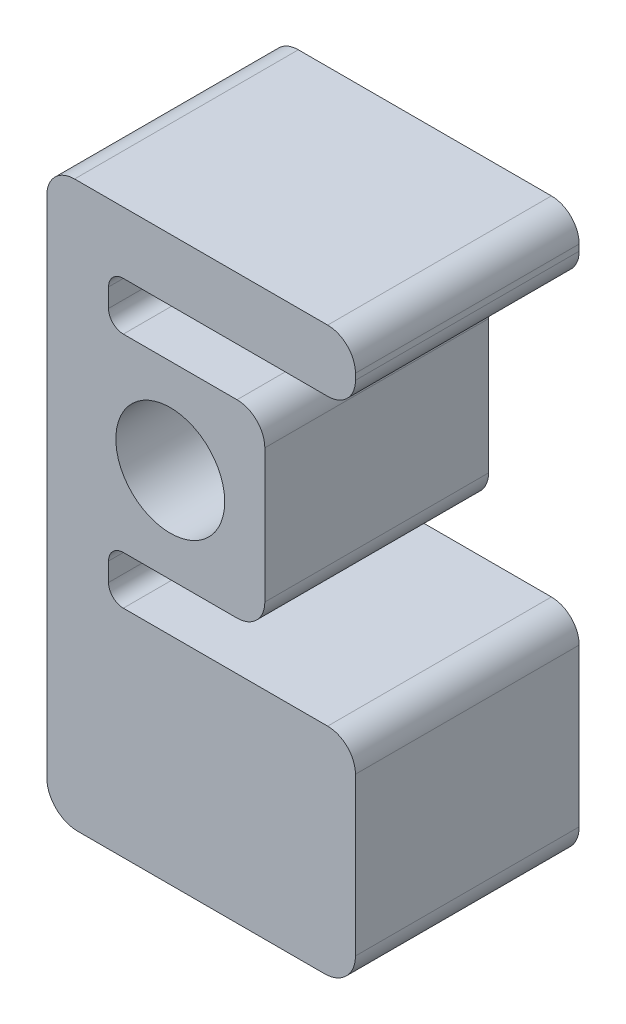
ISO-10303-21;
HEADER;
FILE_DESCRIPTION(('STEP AP214'),'2;1');
FILE_NAME('part.step','',(''),(''),'','','');
FILE_SCHEMA(('AUTOMOTIVE_DESIGN { 1 0 10303 214 1 1 1 1 }'));
ENDSEC;
DATA;
#1=APPLICATION_CONTEXT('core data for automotive mechanical design processes');
#2=APPLICATION_PROTOCOL_DEFINITION('international standard','automotive_design',2000,#1);
#3=PRODUCT_CONTEXT('',#1,'mechanical');
#4=PRODUCT('Part','Part','',(#3));
#5=PRODUCT_RELATED_PRODUCT_CATEGORY('part','',(#4));
#6=PRODUCT_DEFINITION_FORMATION('','',#4);
#7=PRODUCT_DEFINITION_CONTEXT('part definition',#1,'design');
#8=PRODUCT_DEFINITION('design','',#6,#7);
#9=PRODUCT_DEFINITION_SHAPE('','',#8);
#10=(LENGTH_UNIT() NAMED_UNIT(*) SI_UNIT(.MILLI.,.METRE.));
#11=(NAMED_UNIT(*) PLANE_ANGLE_UNIT() SI_UNIT($,.RADIAN.));
#12=(NAMED_UNIT(*) SI_UNIT($,.STERADIAN.) SOLID_ANGLE_UNIT());
#13=UNCERTAINTY_MEASURE_WITH_UNIT(LENGTH_MEASURE(1.E-05),#10,'distance_accuracy_value','');
#14=(GEOMETRIC_REPRESENTATION_CONTEXT(3) GLOBAL_UNCERTAINTY_ASSIGNED_CONTEXT((#13)) GLOBAL_UNIT_ASSIGNED_CONTEXT((#10,
#11,#12)) REPRESENTATION_CONTEXT('',''));
#15=CARTESIAN_POINT('',(0.,0.,0.));
#16=DIRECTION('',(0.,0.,1.));
#17=DIRECTION('',(1.,0.,0.));
#18=AXIS2_PLACEMENT_3D('',#15,#16,#17);
#19=CARTESIAN_POINT('',(-9.65199999999999,-22.503,46.0375));
#20=DIRECTION('',(0.,0.,-1.));
#21=DIRECTION('',(-1.,0.,0.));
#22=AXIS2_PLACEMENT_3D('',#19,#20,#21);
#23=PLANE('',#22);
#24=DIRECTION('',(1.,0.,0.));
#25=VECTOR('',#24,1.);
#26=CARTESIAN_POINT('',(13.74,-19.455,46.0375));
#27=LINE('',#26,#25);
#28=CARTESIAN_POINT('',(-9.65199999999999,-19.455,46.0375));
#29=VERTEX_POINT('',#28);
#30=CARTESIAN_POINT('',(13.74,-19.455,46.0375));
#31=VERTEX_POINT('',#30);
#32=EDGE_CURVE('E63',#29,#31,#27,.T.);
#33=ORIENTED_EDGE('',*,*,#32,.T.);
#34=CARTESIAN_POINT('',(13.74,-13.74,46.0375));
#35=DIRECTION('',(0.,0.,1.));
#36=DIRECTION('',(-1.,0.,0.));
#37=AXIS2_PLACEMENT_3D('',#34,#35,#36);
#38=CIRCLE('',#37,5.715);
#39=CARTESIAN_POINT('',(19.455,-13.74,46.0375));
#40=VERTEX_POINT('',#39);
#41=EDGE_CURVE('E155',#31,#40,#38,.T.);
#42=ORIENTED_EDGE('',*,*,#41,.T.);
#43=DIRECTION('',(0.,1.,0.));
#44=VECTOR('',#43,1.);
#45=CARTESIAN_POINT('',(19.455,0.,46.0375));
#46=LINE('',#45,#44);
#47=CARTESIAN_POINT('',(19.455,13.74,46.0375));
#48=VERTEX_POINT('',#47);
#49=EDGE_CURVE('E402',#40,#48,#46,.T.);
#50=ORIENTED_EDGE('',*,*,#49,.T.);
#51=CARTESIAN_POINT('',(13.74,13.74,46.0375));
#52=DIRECTION('',(0.,0.,1.));
#53=DIRECTION('',(-1.,0.,0.));
#54=AXIS2_PLACEMENT_3D('',#51,#52,#53);
#55=CIRCLE('',#54,5.715);
#56=CARTESIAN_POINT('',(13.74,19.455,46.0375));
#57=VERTEX_POINT('',#56);
#58=EDGE_CURVE('E422',#48,#57,#55,.T.);
#59=ORIENTED_EDGE('',*,*,#58,.T.);
#60=DIRECTION('',(-1.,0.,0.));
#61=VECTOR('',#60,1.);
#62=CARTESIAN_POINT('',(0.,19.455,46.0375));
#63=LINE('',#62,#61);
#64=CARTESIAN_POINT('',(-9.65199999999999,19.455,46.0375));
#65=VERTEX_POINT('',#64);
#66=EDGE_CURVE('E418',#57,#65,#63,.T.);
#67=ORIENTED_EDGE('',*,*,#66,.T.);
#68=CARTESIAN_POINT('',(-9.65199999999999,22.503,46.0375));
#69=DIRECTION('',(0.,0.,-1.));
#70=DIRECTION('',(-1.,0.,0.));
#71=AXIS2_PLACEMENT_3D('',#68,#69,#70);
#72=CIRCLE('',#71,3.048);
#73=CARTESIAN_POINT('',(-12.7,22.503,46.0375));
#74=VERTEX_POINT('',#73);
#75=EDGE_CURVE('E421',#65,#74,#72,.T.);
#76=ORIENTED_EDGE('',*,*,#75,.T.);
#77=DIRECTION('',(0.,1.,0.));
#78=VECTOR('',#77,1.);
#79=CARTESIAN_POINT('',(-12.7,22.503,46.0375));
#80=LINE('',#79,#78);
#81=CARTESIAN_POINT('',(-12.7,26.332,46.0375));
#82=VERTEX_POINT('',#81);
#83=EDGE_CURVE('E426',#74,#82,#80,.T.);
#84=ORIENTED_EDGE('',*,*,#83,.T.);
#85=CARTESIAN_POINT('',(-9.65199999999999,26.332,46.0375));
#86=DIRECTION('',(0.,0.,-1.));
#87=DIRECTION('',(-1.,0.,0.));
#88=AXIS2_PLACEMENT_3D('',#85,#86,#87);
#89=CIRCLE('',#88,3.048);
#90=CARTESIAN_POINT('',(-9.65199999999999,29.38,46.0375));
#91=VERTEX_POINT('',#90);
#92=EDGE_CURVE('E433',#82,#91,#89,.T.);
#93=ORIENTED_EDGE('',*,*,#92,.T.);
#94=DIRECTION('',(1.,0.,0.));
#95=VECTOR('',#94,1.);
#96=CARTESIAN_POINT('',(-9.65199999999999,29.38,46.0375));
#97=LINE('',#96,#95);
#98=CARTESIAN_POINT('',(32.385,29.38,46.0375));
#99=VERTEX_POINT('',#98);
#100=EDGE_CURVE('E436',#91,#99,#97,.T.);
#101=ORIENTED_EDGE('',*,*,#100,.T.);
#102=CARTESIAN_POINT('',(32.385,35.095,46.0375));
#103=DIRECTION('',(0.,0.,1.));
#104=DIRECTION('',(1.,0.,0.));
#105=AXIS2_PLACEMENT_3D('',#102,#103,#104);
#106=CIRCLE('',#105,5.715);
#107=CARTESIAN_POINT('',(38.1,35.095,46.0375));
#108=VERTEX_POINT('',#107);
#109=EDGE_CURVE('E439',#99,#108,#106,.T.);
#110=ORIENTED_EDGE('',*,*,#109,.T.);
#111=DIRECTION('',(0.,1.,0.));
#112=VECTOR('',#111,1.);
#113=CARTESIAN_POINT('',(38.1,35.095,46.0375));
#114=LINE('',#113,#112);
#115=CARTESIAN_POINT('',(38.1,36.365,46.0375));
#116=VERTEX_POINT('',#115);
#117=EDGE_CURVE('E442',#108,#116,#114,.T.);
#118=ORIENTED_EDGE('',*,*,#117,.T.);
#119=CARTESIAN_POINT('',(32.385,36.365,46.0375));
#120=DIRECTION('',(0.,0.,1.));
#121=DIRECTION('',(1.,0.,0.));
#122=AXIS2_PLACEMENT_3D('',#119,#120,#121);
#123=CIRCLE('',#122,5.715);
#124=CARTESIAN_POINT('',(32.385,42.08,46.0375));
#125=VERTEX_POINT('',#124);
#126=EDGE_CURVE('E445',#116,#125,#123,.T.);
#127=ORIENTED_EDGE('',*,*,#126,.T.);
#128=DIRECTION('',(-1.,0.,0.));
#129=VECTOR('',#128,1.);
#130=CARTESIAN_POINT('',(32.385,42.08,46.0375));
#131=LINE('',#130,#129);
#132=CARTESIAN_POINT('',(-19.685,42.08,46.0375));
#133=VERTEX_POINT('',#132);
#134=EDGE_CURVE('E448',#125,#133,#131,.T.);
#135=ORIENTED_EDGE('',*,*,#134,.T.);
#136=CARTESIAN_POINT('',(-19.685,36.365,46.0375));
#137=DIRECTION('',(0.,0.,1.));
#138=DIRECTION('',(1.,0.,0.));
#139=AXIS2_PLACEMENT_3D('',#136,#137,#138);
#140=CIRCLE('',#139,5.71499999999999);
#141=CARTESIAN_POINT('',(-25.4,36.365,46.0375));
#142=VERTEX_POINT('',#141);
#143=EDGE_CURVE('E451',#133,#142,#140,.T.);
#144=ORIENTED_EDGE('',*,*,#143,.T.);
#145=DIRECTION('',(0.,-1.,0.));
#146=VECTOR('',#145,1.);
#147=CARTESIAN_POINT('',(-25.4,-67.4799999619999,46.0375));
#148=LINE('',#147,#146);
#149=CARTESIAN_POINT('',(-25.4,-67.479999962,46.0375));
#150=VERTEX_POINT('',#149);
#151=EDGE_CURVE('E454',#142,#150,#148,.T.);
#152=ORIENTED_EDGE('',*,*,#151,.T.);
#153=CARTESIAN_POINT('',(-19.05,-67.479999962,46.0375));
#154=DIRECTION('',(0.,0.,1.));
#155=DIRECTION('',(-1.,0.,0.));
#156=AXIS2_PLACEMENT_3D('',#153,#154,#155);
#157=CIRCLE('',#156,6.35);
#158=CARTESIAN_POINT('',(-19.0499999999999,-73.829999962,46.0375));
#159=VERTEX_POINT('',#158);
#160=EDGE_CURVE('E457',#150,#159,#157,.T.);
#161=ORIENTED_EDGE('',*,*,#160,.T.);
#162=DIRECTION('',(1.,0.,0.));
#163=VECTOR('',#162,1.);
#164=CARTESIAN_POINT('',(31.75,-73.829999962,46.0375));
#165=LINE('',#164,#163);
#166=CARTESIAN_POINT('',(31.75,-73.829999962,46.0375));
#167=VERTEX_POINT('',#166);
#168=EDGE_CURVE('E460',#159,#167,#165,.T.);
#169=ORIENTED_EDGE('',*,*,#168,.T.);
#170=CARTESIAN_POINT('',(31.75,-67.479999962,46.0375));
#171=DIRECTION('',(0.,0.,1.));
#172=DIRECTION('',(1.,0.,0.));
#173=AXIS2_PLACEMENT_3D('',#170,#171,#172);
#174=CIRCLE('',#173,6.35);
#175=CARTESIAN_POINT('',(38.1,-67.4799999619999,46.0375));
#176=VERTEX_POINT('',#175);
#177=EDGE_CURVE('E463',#167,#176,#174,.T.);
#178=ORIENTED_EDGE('',*,*,#177,.T.);
#179=DIRECTION('',(0.,1.,0.));
#180=VECTOR('',#179,1.);
#181=CARTESIAN_POINT('',(38.1,-67.4799999619999,46.0375));
#182=LINE('',#181,#180);
#183=CARTESIAN_POINT('',(38.1,-35.094999962,46.0375));
#184=VERTEX_POINT('',#183);
#185=EDGE_CURVE('E466',#176,#184,#182,.T.);
#186=ORIENTED_EDGE('',*,*,#185,.T.);
#187=CARTESIAN_POINT('',(32.385,-35.094999962,46.0375));
#188=DIRECTION('',(0.,0.,1.));
#189=DIRECTION('',(1.,0.,0.));
#190=AXIS2_PLACEMENT_3D('',#187,#188,#189);
#191=CIRCLE('',#190,5.71499999999999);
#192=CARTESIAN_POINT('',(32.385,-29.379999962,46.0375));
#193=VERTEX_POINT('',#192);
#194=EDGE_CURVE('E469',#184,#193,#191,.T.);
#195=ORIENTED_EDGE('',*,*,#194,.T.);
#196=DIRECTION('',(-1.,0.,0.));
#197=VECTOR('',#196,1.);
#198=CARTESIAN_POINT('',(32.385,-29.379999962,46.0375));
#199=LINE('',#198,#197);
#200=CARTESIAN_POINT('',(-9.65199999999999,-29.379999962,46.0375));
#201=VERTEX_POINT('',#200);
#202=EDGE_CURVE('E223',#193,#201,#199,.T.);
#203=ORIENTED_EDGE('',*,*,#202,.T.);
#204=CARTESIAN_POINT('',(-9.65199999999999,-26.331999962,46.0375));
#205=DIRECTION('',(0.,0.,-1.));
#206=DIRECTION('',(-1.,0.,0.));
#207=AXIS2_PLACEMENT_3D('',#204,#205,#206);
#208=CIRCLE('',#207,3.048);
#209=CARTESIAN_POINT('',(-12.7,-26.331999962,46.0375));
#210=VERTEX_POINT('',#209);
#211=EDGE_CURVE('E217',#201,#210,#208,.T.);
#212=ORIENTED_EDGE('',*,*,#211,.T.);
#213=DIRECTION('',(0.,1.,0.));
#214=VECTOR('',#213,1.);
#215=CARTESIAN_POINT('',(-12.7,-26.331999962,46.0375));
#216=LINE('',#215,#214);
#217=CARTESIAN_POINT('',(-12.7,-22.503,46.0375));
#218=VERTEX_POINT('',#217);
#219=EDGE_CURVE('E221',#210,#218,#216,.T.);
#220=ORIENTED_EDGE('',*,*,#219,.T.);
#221=CARTESIAN_POINT('',(-9.65199999999999,-22.503,46.0375));
#222=DIRECTION('',(0.,0.,-1.));
#223=DIRECTION('',(-1.,0.,0.));
#224=AXIS2_PLACEMENT_3D('',#221,#222,#223);
#225=CIRCLE('',#224,3.048);
#226=EDGE_CURVE('E240',#218,#29,#225,.T.);
#227=ORIENTED_EDGE('',*,*,#226,.T.);
#228=EDGE_LOOP('',(#33,#42,#50,#59,#67,#76,#84,#93,#101,#110,#118,#127,#135,#144,#152,#161,#169,
#178,#186,#195,#203,#212,#220,#227));
#229=FACE_BOUND('',#228,.T.);
#230=CARTESIAN_POINT('',(0.,0.,46.0375));
#231=DIRECTION('',(0.,0.,1.));
#232=DIRECTION('',(1.,0.,0.));
#233=AXIS2_PLACEMENT_3D('',#230,#231,#232);
#234=CIRCLE('',#233,11.2);
#235=CARTESIAN_POINT('',(11.2,0.,46.0375));
#236=VERTEX_POINT('',#235);
#237=EDGE_CURVE('E252',#236,#236,#234,.T.);
#238=ORIENTED_EDGE('',*,*,#237,.F.);
#239=EDGE_LOOP('',(#238));
#240=FACE_BOUND('',#239,.T.);
#241=ADVANCED_FACE('F45',(#229,#240),#23,.F.);
#242=CARTESIAN_POINT('',(-9.65199999999999,-22.503,0.));
#243=DIRECTION('',(0.,0.,-1.));
#244=DIRECTION('',(-1.,0.,0.));
#245=AXIS2_PLACEMENT_3D('',#242,#243,#244);
#246=PLANE('',#245);
#247=CARTESIAN_POINT('',(13.74,-13.74,0.));
#248=DIRECTION('',(0.,0.,1.));
#249=DIRECTION('',(-1.,0.,0.));
#250=AXIS2_PLACEMENT_3D('',#247,#248,#249);
#251=CIRCLE('',#250,5.715);
#252=CARTESIAN_POINT('',(13.74,-19.455,0.));
#253=VERTEX_POINT('',#252);
#254=CARTESIAN_POINT('',(19.455,-13.74,0.));
#255=VERTEX_POINT('',#254);
#256=EDGE_CURVE('E247',#253,#255,#251,.T.);
#257=ORIENTED_EDGE('',*,*,#256,.F.);
#258=DIRECTION('',(1.,0.,0.));
#259=VECTOR('',#258,1.);
#260=CARTESIAN_POINT('',(-9.65199999999999,-19.455,0.));
#261=LINE('',#260,#259);
#262=CARTESIAN_POINT('',(-9.65199999999999,-19.455,0.));
#263=VERTEX_POINT('',#262);
#264=EDGE_CURVE('E316',#263,#253,#261,.T.);
#265=ORIENTED_EDGE('',*,*,#264,.F.);
#266=CARTESIAN_POINT('',(-9.65199999999999,-22.503,0.));
#267=DIRECTION('',(0.,0.,-1.));
#268=DIRECTION('',(-1.,0.,0.));
#269=AXIS2_PLACEMENT_3D('',#266,#267,#268);
#270=CIRCLE('',#269,3.048);
#271=CARTESIAN_POINT('',(-12.7,-22.503,0.));
#272=VERTEX_POINT('',#271);
#273=EDGE_CURVE('E148',#272,#263,#270,.T.);
#274=ORIENTED_EDGE('',*,*,#273,.F.);
#275=DIRECTION('',(0.,1.,0.));
#276=VECTOR('',#275,1.);
#277=CARTESIAN_POINT('',(-12.7,-26.331999962,0.));
#278=LINE('',#277,#276);
#279=CARTESIAN_POINT('',(-12.7,-26.331999962,0.));
#280=VERTEX_POINT('',#279);
#281=EDGE_CURVE('E141',#280,#272,#278,.T.);
#282=ORIENTED_EDGE('',*,*,#281,.F.);
#283=CARTESIAN_POINT('',(-9.65199999999999,-26.331999962,0.));
#284=DIRECTION('',(0.,0.,-1.));
#285=DIRECTION('',(-1.,0.,0.));
#286=AXIS2_PLACEMENT_3D('',#283,#284,#285);
#287=CIRCLE('',#286,3.048);
#288=CARTESIAN_POINT('',(-9.65199999999999,-29.379999962,0.));
#289=VERTEX_POINT('',#288);
#290=EDGE_CURVE('E232',#289,#280,#287,.T.);
#291=ORIENTED_EDGE('',*,*,#290,.F.);
#292=DIRECTION('',(-1.,0.,0.));
#293=VECTOR('',#292,1.);
#294=CARTESIAN_POINT('',(32.385,-29.379999962,0.));
#295=LINE('',#294,#293);
#296=CARTESIAN_POINT('',(32.385,-29.379999962,0.));
#297=VERTEX_POINT('',#296);
#298=EDGE_CURVE('E307',#297,#289,#295,.T.);
#299=ORIENTED_EDGE('',*,*,#298,.F.);
#300=CARTESIAN_POINT('',(32.385,-35.094999962,0.));
#301=DIRECTION('',(0.,0.,1.));
#302=DIRECTION('',(1.,0.,0.));
#303=AXIS2_PLACEMENT_3D('',#300,#301,#302);
#304=CIRCLE('',#303,5.71499999999999);
#305=CARTESIAN_POINT('',(38.1,-35.094999962,0.));
#306=VERTEX_POINT('',#305);
#307=EDGE_CURVE('E304',#306,#297,#304,.T.);
#308=ORIENTED_EDGE('',*,*,#307,.F.);
#309=DIRECTION('',(0.,1.,0.));
#310=VECTOR('',#309,1.);
#311=CARTESIAN_POINT('',(38.1,-67.4799999619999,0.));
#312=LINE('',#311,#310);
#313=CARTESIAN_POINT('',(38.1,-67.4799999619999,0.));
#314=VERTEX_POINT('',#313);
#315=EDGE_CURVE('E301',#314,#306,#312,.T.);
#316=ORIENTED_EDGE('',*,*,#315,.F.);
#317=CARTESIAN_POINT('',(31.75,-67.479999962,0.));
#318=DIRECTION('',(0.,0.,1.));
#319=DIRECTION('',(1.,0.,0.));
#320=AXIS2_PLACEMENT_3D('',#317,#318,#319);
#321=CIRCLE('',#320,6.35);
#322=CARTESIAN_POINT('',(31.75,-73.829999962,0.));
#323=VERTEX_POINT('',#322);
#324=EDGE_CURVE('E298',#323,#314,#321,.T.);
#325=ORIENTED_EDGE('',*,*,#324,.F.);
#326=DIRECTION('',(1.,0.,0.));
#327=VECTOR('',#326,1.);
#328=CARTESIAN_POINT('',(31.75,-73.829999962,0.));
#329=LINE('',#328,#327);
#330=CARTESIAN_POINT('',(-19.0499999999999,-73.829999962,0.));
#331=VERTEX_POINT('',#330);
#332=EDGE_CURVE('E295',#331,#323,#329,.T.);
#333=ORIENTED_EDGE('',*,*,#332,.F.);
#334=CARTESIAN_POINT('',(-19.05,-67.479999962,0.));
#335=DIRECTION('',(0.,0.,1.));
#336=DIRECTION('',(-1.,0.,0.));
#337=AXIS2_PLACEMENT_3D('',#334,#335,#336);
#338=CIRCLE('',#337,6.35);
#339=CARTESIAN_POINT('',(-25.4,-67.479999962,0.));
#340=VERTEX_POINT('',#339);
#341=EDGE_CURVE('E292',#340,#331,#338,.T.);
#342=ORIENTED_EDGE('',*,*,#341,.F.);
#343=DIRECTION('',(0.,-1.,0.));
#344=VECTOR('',#343,1.);
#345=CARTESIAN_POINT('',(-25.4,-67.4799999619999,0.));
#346=LINE('',#345,#344);
#347=CARTESIAN_POINT('',(-25.4,36.365,0.));
#348=VERTEX_POINT('',#347);
#349=EDGE_CURVE('E289',#348,#340,#346,.T.);
#350=ORIENTED_EDGE('',*,*,#349,.F.);
#351=CARTESIAN_POINT('',(-19.685,36.365,0.));
#352=DIRECTION('',(0.,0.,1.));
#353=DIRECTION('',(1.,0.,0.));
#354=AXIS2_PLACEMENT_3D('',#351,#352,#353);
#355=CIRCLE('',#354,5.71499999999999);
#356=CARTESIAN_POINT('',(-19.685,42.08,0.));
#357=VERTEX_POINT('',#356);
#358=EDGE_CURVE('E286',#357,#348,#355,.T.);
#359=ORIENTED_EDGE('',*,*,#358,.F.);
#360=DIRECTION('',(-1.,0.,0.));
#361=VECTOR('',#360,1.);
#362=CARTESIAN_POINT('',(32.385,42.08,0.));
#363=LINE('',#362,#361);
#364=CARTESIAN_POINT('',(32.385,42.08,0.));
#365=VERTEX_POINT('',#364);
#366=EDGE_CURVE('E283',#365,#357,#363,.T.);
#367=ORIENTED_EDGE('',*,*,#366,.F.);
#368=CARTESIAN_POINT('',(32.385,36.365,0.));
#369=DIRECTION('',(0.,0.,1.));
#370=DIRECTION('',(1.,0.,0.));
#371=AXIS2_PLACEMENT_3D('',#368,#369,#370);
#372=CIRCLE('',#371,5.715);
#373=CARTESIAN_POINT('',(38.1,36.365,0.));
#374=VERTEX_POINT('',#373);
#375=EDGE_CURVE('E280',#374,#365,#372,.T.);
#376=ORIENTED_EDGE('',*,*,#375,.F.);
#377=DIRECTION('',(0.,1.,0.));
#378=VECTOR('',#377,1.);
#379=CARTESIAN_POINT('',(38.1,35.095,0.));
#380=LINE('',#379,#378);
#381=CARTESIAN_POINT('',(38.1,35.095,0.));
#382=VERTEX_POINT('',#381);
#383=EDGE_CURVE('E277',#382,#374,#380,.T.);
#384=ORIENTED_EDGE('',*,*,#383,.F.);
#385=CARTESIAN_POINT('',(32.385,35.095,0.));
#386=DIRECTION('',(0.,0.,1.));
#387=DIRECTION('',(1.,0.,0.));
#388=AXIS2_PLACEMENT_3D('',#385,#386,#387);
#389=CIRCLE('',#388,5.715);
#390=CARTESIAN_POINT('',(32.385,29.38,0.));
#391=VERTEX_POINT('',#390);
#392=EDGE_CURVE('E274',#391,#382,#389,.T.);
#393=ORIENTED_EDGE('',*,*,#392,.F.);
#394=DIRECTION('',(1.,0.,0.));
#395=VECTOR('',#394,1.);
#396=CARTESIAN_POINT('',(-9.65199999999999,29.38,0.));
#397=LINE('',#396,#395);
#398=CARTESIAN_POINT('',(-9.65199999999999,29.38,0.));
#399=VERTEX_POINT('',#398);
#400=EDGE_CURVE('E271',#399,#391,#397,.T.);
#401=ORIENTED_EDGE('',*,*,#400,.F.);
#402=CARTESIAN_POINT('',(-9.65199999999999,26.332,0.));
#403=DIRECTION('',(0.,0.,-1.));
#404=DIRECTION('',(-1.,0.,0.));
#405=AXIS2_PLACEMENT_3D('',#402,#403,#404);
#406=CIRCLE('',#405,3.048);
#407=CARTESIAN_POINT('',(-12.7,26.332,0.));
#408=VERTEX_POINT('',#407);
#409=EDGE_CURVE('E268',#408,#399,#406,.T.);
#410=ORIENTED_EDGE('',*,*,#409,.F.);
#411=DIRECTION('',(0.,1.,0.));
#412=VECTOR('',#411,1.);
#413=CARTESIAN_POINT('',(-12.7,22.503,0.));
#414=LINE('',#413,#412);
#415=CARTESIAN_POINT('',(-12.7,22.503,0.));
#416=VERTEX_POINT('',#415);
#417=EDGE_CURVE('E265',#416,#408,#414,.T.);
#418=ORIENTED_EDGE('',*,*,#417,.F.);
#419=CARTESIAN_POINT('',(-9.65199999999999,22.503,0.));
#420=DIRECTION('',(0.,0.,-1.));
#421=DIRECTION('',(-1.,0.,0.));
#422=AXIS2_PLACEMENT_3D('',#419,#420,#421);
#423=CIRCLE('',#422,3.048);
#424=CARTESIAN_POINT('',(-9.65199999999999,19.455,0.));
#425=VERTEX_POINT('',#424);
#426=EDGE_CURVE('E262',#425,#416,#423,.T.);
#427=ORIENTED_EDGE('',*,*,#426,.F.);
#428=DIRECTION('',(-1.,0.,0.));
#429=VECTOR('',#428,1.);
#430=CARTESIAN_POINT('',(-9.65199999999999,19.455,0.));
#431=LINE('',#430,#429);
#432=CARTESIAN_POINT('',(13.74,19.455,0.));
#433=VERTEX_POINT('',#432);
#434=EDGE_CURVE('E259',#433,#425,#431,.T.);
#435=ORIENTED_EDGE('',*,*,#434,.F.);
#436=CARTESIAN_POINT('',(13.74,13.74,0.));
#437=DIRECTION('',(0.,0.,1.));
#438=DIRECTION('',(-1.,0.,0.));
#439=AXIS2_PLACEMENT_3D('',#436,#437,#438);
#440=CIRCLE('',#439,5.715);
#441=CARTESIAN_POINT('',(19.455,13.74,0.));
#442=VERTEX_POINT('',#441);
#443=EDGE_CURVE('E255',#442,#433,#440,.T.);
#444=ORIENTED_EDGE('',*,*,#443,.F.);
#445=DIRECTION('',(0.,1.,0.));
#446=VECTOR('',#445,1.);
#447=CARTESIAN_POINT('',(19.455,13.74,0.));
#448=LINE('',#447,#446);
#449=EDGE_CURVE('E251',#255,#442,#448,.T.);
#450=ORIENTED_EDGE('',*,*,#449,.F.);
#451=EDGE_LOOP('',(#257,#265,#274,#282,#291,#299,#308,#316,#325,#333,#342,#350,#359,#367,#376,
#384,#393,#401,#410,#418,#427,#435,#444,#450));
#452=FACE_BOUND('',#451,.T.);
#453=CARTESIAN_POINT('',(0.,0.,0.));
#454=DIRECTION('',(0.,0.,1.));
#455=DIRECTION('',(1.,0.,0.));
#456=AXIS2_PLACEMENT_3D('',#453,#454,#455);
#457=CIRCLE('',#456,11.2);
#458=CARTESIAN_POINT('',(11.2,0.,0.));
#459=VERTEX_POINT('',#458);
#460=EDGE_CURVE('E780',#459,#459,#457,.T.);
#461=ORIENTED_EDGE('',*,*,#460,.T.);
#462=EDGE_LOOP('',(#461));
#463=FACE_BOUND('',#462,.T.);
#464=ADVANCED_FACE('F406',(#452,#463),#246,.T.);
#465=CARTESIAN_POINT('',(13.74,-13.74,46.0375));
#466=DIRECTION('',(0.,0.,-1.));
#467=DIRECTION('',(-1.,0.,0.));
#468=AXIS2_PLACEMENT_3D('',#465,#466,#467);
#469=CYLINDRICAL_SURFACE('',#468,5.715);
#470=ORIENTED_EDGE('',*,*,#256,.T.);
#471=DIRECTION('',(0.,0.,-1.));
#472=VECTOR('',#471,1.);
#473=CARTESIAN_POINT('',(19.455,-13.74,46.0375));
#474=LINE('',#473,#472);
#475=EDGE_CURVE('E55',#40,#255,#474,.T.);
#476=ORIENTED_EDGE('',*,*,#475,.F.);
#477=ORIENTED_EDGE('',*,*,#41,.F.);
#478=DIRECTION('',(0.,0.,-1.));
#479=VECTOR('',#478,1.);
#480=CARTESIAN_POINT('',(13.74,-19.455,46.0375));
#481=LINE('',#480,#479);
#482=EDGE_CURVE('E11',#31,#253,#481,.T.);
#483=ORIENTED_EDGE('',*,*,#482,.T.);
#484=EDGE_LOOP('',(#470,#476,#477,#483));
#485=FACE_BOUND('',#484,.T.);
#486=ADVANCED_FACE('F47',(#485),#469,.T.);
#487=CARTESIAN_POINT('',(19.455,13.74,46.0375));
#488=DIRECTION('',(-1.,0.,0.));
#489=DIRECTION('',(0.,0.,1.));
#490=AXIS2_PLACEMENT_3D('',#487,#488,#489);
#491=PLANE('',#490);
#492=ORIENTED_EDGE('',*,*,#449,.T.);
#493=DIRECTION('',(0.,0.,-1.));
#494=VECTOR('',#493,1.);
#495=CARTESIAN_POINT('',(19.455,13.74,46.0375));
#496=LINE('',#495,#494);
#497=EDGE_CURVE('E393',#48,#442,#496,.T.);
#498=ORIENTED_EDGE('',*,*,#497,.F.);
#499=ORIENTED_EDGE('',*,*,#49,.F.);
#500=ORIENTED_EDGE('',*,*,#475,.T.);
#501=EDGE_LOOP('',(#492,#498,#499,#500));
#502=FACE_BOUND('',#501,.T.);
#503=ADVANCED_FACE('F400',(#502),#491,.F.);
#504=CARTESIAN_POINT('',(13.74,13.74,46.0375));
#505=DIRECTION('',(0.,0.,-1.));
#506=DIRECTION('',(-1.,0.,0.));
#507=AXIS2_PLACEMENT_3D('',#504,#505,#506);
#508=CYLINDRICAL_SURFACE('',#507,5.715);
#509=ORIENTED_EDGE('',*,*,#443,.T.);
#510=DIRECTION('',(0.,0.,-1.));
#511=VECTOR('',#510,1.);
#512=CARTESIAN_POINT('',(13.74,19.455,46.0375));
#513=LINE('',#512,#511);
#514=EDGE_CURVE('E389',#57,#433,#513,.T.);
#515=ORIENTED_EDGE('',*,*,#514,.F.);
#516=ORIENTED_EDGE('',*,*,#58,.F.);
#517=ORIENTED_EDGE('',*,*,#497,.T.);
#518=EDGE_LOOP('',(#509,#515,#516,#517));
#519=FACE_BOUND('',#518,.T.);
#520=ADVANCED_FACE('F412',(#519),#508,.T.);
#521=CARTESIAN_POINT('',(-9.65199999999999,19.455,46.0375));
#522=DIRECTION('',(0.,-1.,0.));
#523=DIRECTION('',(1.,0.,0.));
#524=AXIS2_PLACEMENT_3D('',#521,#522,#523);
#525=PLANE('',#524);
#526=ORIENTED_EDGE('',*,*,#434,.T.);
#527=DIRECTION('',(0.,0.,-1.));
#528=VECTOR('',#527,1.);
#529=CARTESIAN_POINT('',(-9.65199999999999,19.455,46.0375));
#530=LINE('',#529,#528);
#531=EDGE_CURVE('E385',#65,#425,#530,.T.);
#532=ORIENTED_EDGE('',*,*,#531,.F.);
#533=ORIENTED_EDGE('',*,*,#66,.F.);
#534=ORIENTED_EDGE('',*,*,#514,.T.);
#535=EDGE_LOOP('',(#526,#532,#533,#534));
#536=FACE_BOUND('',#535,.T.);
#537=ADVANCED_FACE('F416',(#536),#525,.F.);
#538=CARTESIAN_POINT('',(-9.65199999999999,22.503,46.0375));
#539=DIRECTION('',(0.,0.,-1.));
#540=DIRECTION('',(-1.,0.,0.));
#541=AXIS2_PLACEMENT_3D('',#538,#539,#540);
#542=CYLINDRICAL_SURFACE('',#541,3.048);
#543=ORIENTED_EDGE('',*,*,#426,.T.);
#544=DIRECTION('',(0.,0.,-1.));
#545=VECTOR('',#544,1.);
#546=CARTESIAN_POINT('',(-12.7,22.503,46.0375));
#547=LINE('',#546,#545);
#548=EDGE_CURVE('E381',#74,#416,#547,.T.);
#549=ORIENTED_EDGE('',*,*,#548,.F.);
#550=ORIENTED_EDGE('',*,*,#75,.F.);
#551=ORIENTED_EDGE('',*,*,#531,.T.);
#552=EDGE_LOOP('',(#543,#549,#550,#551));
#553=FACE_BOUND('',#552,.T.);
#554=ADVANCED_FACE('F547',(#553),#542,.F.);
#555=CARTESIAN_POINT('',(-12.7,22.503,46.0375));
#556=DIRECTION('',(-1.,0.,0.));
#557=DIRECTION('',(0.,0.,1.));
#558=AXIS2_PLACEMENT_3D('',#555,#556,#557);
#559=PLANE('',#558);
#560=ORIENTED_EDGE('',*,*,#417,.T.);
#561=DIRECTION('',(0.,0.,-1.));
#562=VECTOR('',#561,1.);
#563=CARTESIAN_POINT('',(-12.7,26.332,46.0375));
#564=LINE('',#563,#562);
#565=EDGE_CURVE('E377',#82,#408,#564,.T.);
#566=ORIENTED_EDGE('',*,*,#565,.F.);
#567=ORIENTED_EDGE('',*,*,#83,.F.);
#568=ORIENTED_EDGE('',*,*,#548,.T.);
#569=EDGE_LOOP('',(#560,#566,#567,#568));
#570=FACE_BOUND('',#569,.T.);
#571=ADVANCED_FACE('F543',(#570),#559,.F.);
#572=CARTESIAN_POINT('',(-9.65199999999999,26.332,46.0375));
#573=DIRECTION('',(0.,0.,-1.));
#574=DIRECTION('',(-1.,0.,0.));
#575=AXIS2_PLACEMENT_3D('',#572,#573,#574);
#576=CYLINDRICAL_SURFACE('',#575,3.048);
#577=ORIENTED_EDGE('',*,*,#409,.T.);
#578=DIRECTION('',(0.,0.,-1.));
#579=VECTOR('',#578,1.);
#580=CARTESIAN_POINT('',(-9.65199999999999,29.38,46.0375));
#581=LINE('',#580,#579);
#582=EDGE_CURVE('E373',#91,#399,#581,.T.);
#583=ORIENTED_EDGE('',*,*,#582,.F.);
#584=ORIENTED_EDGE('',*,*,#92,.F.);
#585=ORIENTED_EDGE('',*,*,#565,.T.);
#586=EDGE_LOOP('',(#577,#583,#584,#585));
#587=FACE_BOUND('',#586,.T.);
#588=ADVANCED_FACE('F539',(#587),#576,.F.);
#589=CARTESIAN_POINT('',(-9.65199999999999,29.38,46.0375));
#590=DIRECTION('',(0.,1.,0.));
#591=DIRECTION('',(0.,0.,1.));
#592=AXIS2_PLACEMENT_3D('',#589,#590,#591);
#593=PLANE('',#592);
#594=ORIENTED_EDGE('',*,*,#400,.T.);
#595=DIRECTION('',(0.,0.,-1.));
#596=VECTOR('',#595,1.);
#597=CARTESIAN_POINT('',(32.385,29.38,46.0375));
#598=LINE('',#597,#596);
#599=EDGE_CURVE('E369',#99,#391,#598,.T.);
#600=ORIENTED_EDGE('',*,*,#599,.F.);
#601=ORIENTED_EDGE('',*,*,#100,.F.);
#602=ORIENTED_EDGE('',*,*,#582,.T.);
#603=EDGE_LOOP('',(#594,#600,#601,#602));
#604=FACE_BOUND('',#603,.T.);
#605=ADVANCED_FACE('F535',(#604),#593,.F.);
#606=CARTESIAN_POINT('',(32.385,35.095,46.0375));
#607=DIRECTION('',(0.,0.,-1.));
#608=DIRECTION('',(-1.,0.,0.));
#609=AXIS2_PLACEMENT_3D('',#606,#607,#608);
#610=CYLINDRICAL_SURFACE('',#609,5.715);
#611=ORIENTED_EDGE('',*,*,#392,.T.);
#612=DIRECTION('',(0.,0.,-1.));
#613=VECTOR('',#612,1.);
#614=CARTESIAN_POINT('',(38.1,35.095,46.0375));
#615=LINE('',#614,#613);
#616=EDGE_CURVE('E365',#108,#382,#615,.T.);
#617=ORIENTED_EDGE('',*,*,#616,.F.);
#618=ORIENTED_EDGE('',*,*,#109,.F.);
#619=ORIENTED_EDGE('',*,*,#599,.T.);
#620=EDGE_LOOP('',(#611,#617,#618,#619));
#621=FACE_BOUND('',#620,.T.);
#622=ADVANCED_FACE('F530',(#621),#610,.T.);
#623=CARTESIAN_POINT('',(38.1,35.095,46.0375));
#624=DIRECTION('',(-1.,0.,0.));
#625=DIRECTION('',(0.,-1.,0.));
#626=AXIS2_PLACEMENT_3D('',#623,#624,#625);
#627=PLANE('',#626);
#628=ORIENTED_EDGE('',*,*,#383,.T.);
#629=DIRECTION('',(0.,0.,-1.));
#630=VECTOR('',#629,1.);
#631=CARTESIAN_POINT('',(38.1,36.365,46.0375));
#632=LINE('',#631,#630);
#633=EDGE_CURVE('E361',#116,#374,#632,.T.);
#634=ORIENTED_EDGE('',*,*,#633,.F.);
#635=ORIENTED_EDGE('',*,*,#117,.F.);
#636=ORIENTED_EDGE('',*,*,#616,.T.);
#637=EDGE_LOOP('',(#628,#634,#635,#636));
#638=FACE_BOUND('',#637,.T.);
#639=ADVANCED_FACE('F524',(#638),#627,.F.);
#640=CARTESIAN_POINT('',(32.385,36.365,46.0375));
#641=DIRECTION('',(0.,0.,-1.));
#642=DIRECTION('',(-1.,0.,0.));
#643=AXIS2_PLACEMENT_3D('',#640,#641,#642);
#644=CYLINDRICAL_SURFACE('',#643,5.715);
#645=ORIENTED_EDGE('',*,*,#375,.T.);
#646=DIRECTION('',(0.,0.,-1.));
#647=VECTOR('',#646,1.);
#648=CARTESIAN_POINT('',(32.385,42.08,46.0375));
#649=LINE('',#648,#647);
#650=EDGE_CURVE('E357',#125,#365,#649,.T.);
#651=ORIENTED_EDGE('',*,*,#650,.F.);
#652=ORIENTED_EDGE('',*,*,#126,.F.);
#653=ORIENTED_EDGE('',*,*,#633,.T.);
#654=EDGE_LOOP('',(#645,#651,#652,#653));
#655=FACE_BOUND('',#654,.T.);
#656=ADVANCED_FACE('F520',(#655),#644,.T.);
#657=CARTESIAN_POINT('',(32.385,42.08,46.0375));
#658=DIRECTION('',(0.,-1.,0.));
#659=DIRECTION('',(1.,0.,0.));
#660=AXIS2_PLACEMENT_3D('',#657,#658,#659);
#661=PLANE('',#660);
#662=ORIENTED_EDGE('',*,*,#366,.T.);
#663=DIRECTION('',(0.,0.,-1.));
#664=VECTOR('',#663,1.);
#665=CARTESIAN_POINT('',(-19.685,42.08,46.0375));
#666=LINE('',#665,#664);
#667=EDGE_CURVE('E353',#133,#357,#666,.T.);
#668=ORIENTED_EDGE('',*,*,#667,.F.);
#669=ORIENTED_EDGE('',*,*,#134,.F.);
#670=ORIENTED_EDGE('',*,*,#650,.T.);
#671=EDGE_LOOP('',(#662,#668,#669,#670));
#672=FACE_BOUND('',#671,.T.);
#673=ADVANCED_FACE('F515',(#672),#661,.F.);
#674=CARTESIAN_POINT('',(-19.685,36.365,46.0375));
#675=DIRECTION('',(0.,0.,-1.));
#676=DIRECTION('',(-1.,0.,0.));
#677=AXIS2_PLACEMENT_3D('',#674,#675,#676);
#678=CYLINDRICAL_SURFACE('',#677,5.71499999999999);
#679=ORIENTED_EDGE('',*,*,#358,.T.);
#680=DIRECTION('',(0.,0.,-1.));
#681=VECTOR('',#680,1.);
#682=CARTESIAN_POINT('',(-25.4,36.365,46.0375));
#683=LINE('',#682,#681);
#684=EDGE_CURVE('E349',#142,#348,#683,.T.);
#685=ORIENTED_EDGE('',*,*,#684,.F.);
#686=ORIENTED_EDGE('',*,*,#143,.F.);
#687=ORIENTED_EDGE('',*,*,#667,.T.);
#688=EDGE_LOOP('',(#679,#685,#686,#687));
#689=FACE_BOUND('',#688,.T.);
#690=ADVANCED_FACE('F509',(#689),#678,.T.);
#691=CARTESIAN_POINT('',(-25.4,-67.4799999619999,46.0375));
#692=DIRECTION('',(1.,0.,0.));
#693=DIRECTION('',(0.,1.,0.));
#694=AXIS2_PLACEMENT_3D('',#691,#692,#693);
#695=PLANE('',#694);
#696=ORIENTED_EDGE('',*,*,#349,.T.);
#697=DIRECTION('',(0.,0.,-1.));
#698=VECTOR('',#697,1.);
#699=CARTESIAN_POINT('',(-25.4,-67.479999962,46.0375));
#700=LINE('',#699,#698);
#701=EDGE_CURVE('E345',#150,#340,#700,.T.);
#702=ORIENTED_EDGE('',*,*,#701,.F.);
#703=ORIENTED_EDGE('',*,*,#151,.F.);
#704=ORIENTED_EDGE('',*,*,#684,.T.);
#705=EDGE_LOOP('',(#696,#702,#703,#704));
#706=FACE_BOUND('',#705,.T.);
#707=ADVANCED_FACE('F505',(#706),#695,.F.);
#708=CARTESIAN_POINT('',(-19.05,-67.479999962,46.0375));
#709=DIRECTION('',(0.,0.,-1.));
#710=DIRECTION('',(-1.,0.,0.));
#711=AXIS2_PLACEMENT_3D('',#708,#709,#710);
#712=CYLINDRICAL_SURFACE('',#711,6.35);
#713=ORIENTED_EDGE('',*,*,#341,.T.);
#714=DIRECTION('',(0.,0.,-1.));
#715=VECTOR('',#714,1.);
#716=CARTESIAN_POINT('',(-19.0499999999999,-73.829999962,46.0375));
#717=LINE('',#716,#715);
#718=EDGE_CURVE('E341',#159,#331,#717,.T.);
#719=ORIENTED_EDGE('',*,*,#718,.F.);
#720=ORIENTED_EDGE('',*,*,#160,.F.);
#721=ORIENTED_EDGE('',*,*,#701,.T.);
#722=EDGE_LOOP('',(#713,#719,#720,#721));
#723=FACE_BOUND('',#722,.T.);
#724=ADVANCED_FACE('F500',(#723),#712,.T.);
#725=CARTESIAN_POINT('',(31.75,-73.829999962,46.0375));
#726=DIRECTION('',(0.,1.,0.));
#727=DIRECTION('',(0.,0.,1.));
#728=AXIS2_PLACEMENT_3D('',#725,#726,#727);
#729=PLANE('',#728);
#730=ORIENTED_EDGE('',*,*,#332,.T.);
#731=DIRECTION('',(0.,0.,-1.));
#732=VECTOR('',#731,1.);
#733=CARTESIAN_POINT('',(31.75,-73.829999962,46.0375));
#734=LINE('',#733,#732);
#735=EDGE_CURVE('E337',#167,#323,#734,.T.);
#736=ORIENTED_EDGE('',*,*,#735,.F.);
#737=ORIENTED_EDGE('',*,*,#168,.F.);
#738=ORIENTED_EDGE('',*,*,#718,.T.);
#739=EDGE_LOOP('',(#730,#736,#737,#738));
#740=FACE_BOUND('',#739,.T.);
#741=ADVANCED_FACE('F494',(#740),#729,.F.);
#742=CARTESIAN_POINT('',(31.75,-67.479999962,46.0375));
#743=DIRECTION('',(0.,0.,-1.));
#744=DIRECTION('',(-1.,0.,0.));
#745=AXIS2_PLACEMENT_3D('',#742,#743,#744);
#746=CYLINDRICAL_SURFACE('',#745,6.35);
#747=ORIENTED_EDGE('',*,*,#324,.T.);
#748=DIRECTION('',(0.,0.,-1.));
#749=VECTOR('',#748,1.);
#750=CARTESIAN_POINT('',(38.1,-67.4799999619999,46.0375));
#751=LINE('',#750,#749);
#752=EDGE_CURVE('E333',#176,#314,#751,.T.);
#753=ORIENTED_EDGE('',*,*,#752,.F.);
#754=ORIENTED_EDGE('',*,*,#177,.F.);
#755=ORIENTED_EDGE('',*,*,#735,.T.);
#756=EDGE_LOOP('',(#747,#753,#754,#755));
#757=FACE_BOUND('',#756,.T.);
#758=ADVANCED_FACE('F490',(#757),#746,.T.);
#759=CARTESIAN_POINT('',(38.1,-67.4799999619999,46.0375));
#760=DIRECTION('',(-1.,0.,0.));
#761=DIRECTION('',(0.,-1.,0.));
#762=AXIS2_PLACEMENT_3D('',#759,#760,#761);
#763=PLANE('',#762);
#764=ORIENTED_EDGE('',*,*,#315,.T.);
#765=DIRECTION('',(0.,0.,-1.));
#766=VECTOR('',#765,1.);
#767=CARTESIAN_POINT('',(38.1,-35.094999962,46.0375));
#768=LINE('',#767,#766);
#769=EDGE_CURVE('E329',#184,#306,#768,.T.);
#770=ORIENTED_EDGE('',*,*,#769,.F.);
#771=ORIENTED_EDGE('',*,*,#185,.F.);
#772=ORIENTED_EDGE('',*,*,#752,.T.);
#773=EDGE_LOOP('',(#764,#770,#771,#772));
#774=FACE_BOUND('',#773,.T.);
#775=ADVANCED_FACE('F486',(#774),#763,.F.);
#776=CARTESIAN_POINT('',(32.385,-35.094999962,46.0375));
#777=DIRECTION('',(0.,0.,-1.));
#778=DIRECTION('',(-1.,0.,0.));
#779=AXIS2_PLACEMENT_3D('',#776,#777,#778);
#780=CYLINDRICAL_SURFACE('',#779,5.71499999999999);
#781=ORIENTED_EDGE('',*,*,#307,.T.);
#782=DIRECTION('',(0.,0.,-1.));
#783=VECTOR('',#782,1.);
#784=CARTESIAN_POINT('',(32.385,-29.379999962,46.0375));
#785=LINE('',#784,#783);
#786=EDGE_CURVE('E325',#193,#297,#785,.T.);
#787=ORIENTED_EDGE('',*,*,#786,.F.);
#788=ORIENTED_EDGE('',*,*,#194,.F.);
#789=ORIENTED_EDGE('',*,*,#769,.T.);
#790=EDGE_LOOP('',(#781,#787,#788,#789));
#791=FACE_BOUND('',#790,.T.);
#792=ADVANCED_FACE('F477',(#791),#780,.T.);
#793=CARTESIAN_POINT('',(32.385,-29.379999962,46.0375));
#794=DIRECTION('',(0.,-1.,0.));
#795=DIRECTION('',(1.,0.,0.));
#796=AXIS2_PLACEMENT_3D('',#793,#794,#795);
#797=PLANE('',#796);
#798=ORIENTED_EDGE('',*,*,#298,.T.);
#799=DIRECTION('',(0.,0.,-1.));
#800=VECTOR('',#799,1.);
#801=CARTESIAN_POINT('',(-9.65199999999999,-29.379999962,46.0375));
#802=LINE('',#801,#800);
#803=EDGE_CURVE('E234',#201,#289,#802,.T.);
#804=ORIENTED_EDGE('',*,*,#803,.F.);
#805=ORIENTED_EDGE('',*,*,#202,.F.);
#806=ORIENTED_EDGE('',*,*,#786,.T.);
#807=EDGE_LOOP('',(#798,#804,#805,#806));
#808=FACE_BOUND('',#807,.T.);
#809=ADVANCED_FACE('F481',(#808),#797,.F.);
#810=CARTESIAN_POINT('',(-9.65199999999999,-26.331999962,46.0375));
#811=DIRECTION('',(0.,0.,-1.));
#812=DIRECTION('',(-1.,0.,0.));
#813=AXIS2_PLACEMENT_3D('',#810,#811,#812);
#814=CYLINDRICAL_SURFACE('',#813,3.048);
#815=ORIENTED_EDGE('',*,*,#290,.T.);
#816=DIRECTION('',(0.,0.,-1.));
#817=VECTOR('',#816,1.);
#818=CARTESIAN_POINT('',(-12.7,-26.331999962,46.0375));
#819=LINE('',#818,#817);
#820=EDGE_CURVE('E229',#210,#280,#819,.T.);
#821=ORIENTED_EDGE('',*,*,#820,.F.);
#822=ORIENTED_EDGE('',*,*,#211,.F.);
#823=ORIENTED_EDGE('',*,*,#803,.T.);
#824=EDGE_LOOP('',(#815,#821,#822,#823));
#825=FACE_BOUND('',#824,.T.);
#826=ADVANCED_FACE('F230',(#825),#814,.F.);
#827=CARTESIAN_POINT('',(-12.7,-26.331999962,46.0375));
#828=DIRECTION('',(-1.,0.,0.));
#829=DIRECTION('',(0.,0.,1.));
#830=AXIS2_PLACEMENT_3D('',#827,#828,#829);
#831=PLANE('',#830);
#832=ORIENTED_EDGE('',*,*,#281,.T.);
#833=DIRECTION('',(0.,0.,-1.));
#834=VECTOR('',#833,1.);
#835=CARTESIAN_POINT('',(-12.7,-22.503,46.0375));
#836=LINE('',#835,#834);
#837=EDGE_CURVE('E235',#218,#272,#836,.T.);
#838=ORIENTED_EDGE('',*,*,#837,.F.);
#839=ORIENTED_EDGE('',*,*,#219,.F.);
#840=ORIENTED_EDGE('',*,*,#820,.T.);
#841=EDGE_LOOP('',(#832,#838,#839,#840));
#842=FACE_BOUND('',#841,.T.);
#843=ADVANCED_FACE('F237',(#842),#831,.F.);
#844=CARTESIAN_POINT('',(-9.65199999999999,-22.503,46.0375));
#845=DIRECTION('',(0.,0.,-1.));
#846=DIRECTION('',(-1.,0.,0.));
#847=AXIS2_PLACEMENT_3D('',#844,#845,#846);
#848=CYLINDRICAL_SURFACE('',#847,3.048);
#849=ORIENTED_EDGE('',*,*,#273,.T.);
#850=DIRECTION('',(0.,0.,-1.));
#851=VECTOR('',#850,1.);
#852=CARTESIAN_POINT('',(-9.65199999999999,-19.455,46.0375));
#853=LINE('',#852,#851);
#854=EDGE_CURVE('E243',#29,#263,#853,.T.);
#855=ORIENTED_EDGE('',*,*,#854,.F.);
#856=ORIENTED_EDGE('',*,*,#226,.F.);
#857=ORIENTED_EDGE('',*,*,#837,.T.);
#858=EDGE_LOOP('',(#849,#855,#856,#857));
#859=FACE_BOUND('',#858,.T.);
#860=ADVANCED_FACE('F568',(#859),#848,.F.);
#861=CARTESIAN_POINT('',(-9.65199999999999,-19.455,46.0375));
#862=DIRECTION('',(0.,1.,0.));
#863=DIRECTION('',(-1.,0.,0.));
#864=AXIS2_PLACEMENT_3D('',#861,#862,#863);
#865=PLANE('',#864);
#866=ORIENTED_EDGE('',*,*,#264,.T.);
#867=ORIENTED_EDGE('',*,*,#482,.F.);
#868=ORIENTED_EDGE('',*,*,#32,.F.);
#869=ORIENTED_EDGE('',*,*,#854,.T.);
#870=EDGE_LOOP('',(#866,#867,#868,#869));
#871=FACE_BOUND('',#870,.T.);
#872=ADVANCED_FACE('F565',(#871),#865,.F.);
#873=CARTESIAN_POINT('',(0.,0.,46.0375));
#874=DIRECTION('',(0.,0.,-1.));
#875=DIRECTION('',(-1.,0.,0.));
#876=AXIS2_PLACEMENT_3D('',#873,#874,#875);
#877=CYLINDRICAL_SURFACE('',#876,11.2);
#878=ORIENTED_EDGE('',*,*,#237,.T.);
#879=EDGE_LOOP('',(#878));
#880=FACE_BOUND('',#879,.T.);
#881=ORIENTED_EDGE('',*,*,#460,.F.);
#882=EDGE_LOOP('',(#881));
#883=FACE_BOUND('',#882,.T.);
#884=ADVANCED_FACE('F563',(#880,#883),#877,.F.);
#885=CLOSED_SHELL('',(#241,#464,#486,#503,#520,#537,#554,#571,#588,#605,#622,#639,#656,#673,
#690,#707,#724,#741,#758,#775,#792,#809,#826,#843,#860,#872,#884));
#886=MANIFOLD_SOLID_BREP('B2',#885);
#887=ADVANCED_BREP_SHAPE_REPRESENTATION('',(#18,#886),#14);
#888=SHAPE_DEFINITION_REPRESENTATION(#9,#887);
ENDSEC;
END-ISO-10303-21;
